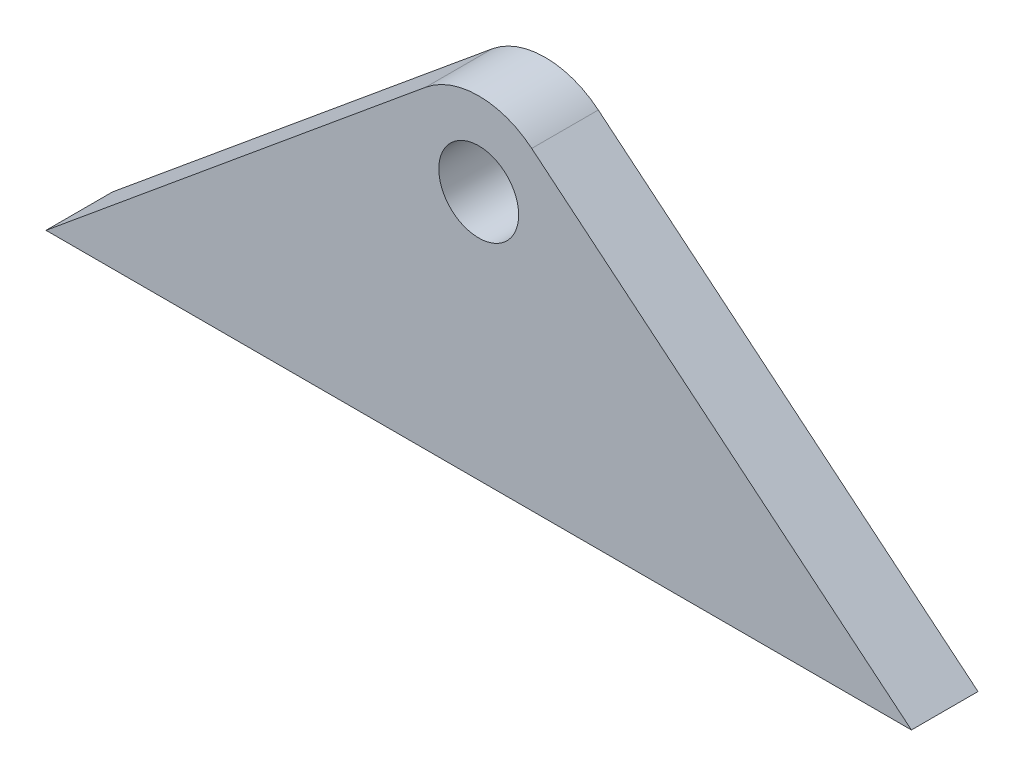
ISO-10303-21;
HEADER;
FILE_DESCRIPTION(('STEP AP214'),'2;1');
FILE_NAME('part.step','',(''),(''),'','','');
FILE_SCHEMA(('AUTOMOTIVE_DESIGN { 1 0 10303 214 1 1 1 1 }'));
ENDSEC;
DATA;
#1=APPLICATION_CONTEXT('core data for automotive mechanical design processes');
#2=APPLICATION_PROTOCOL_DEFINITION('international standard','automotive_design',2000,#1);
#3=PRODUCT_CONTEXT('',#1,'mechanical');
#4=PRODUCT('Part','Part','',(#3));
#5=PRODUCT_RELATED_PRODUCT_CATEGORY('part','',(#4));
#6=PRODUCT_DEFINITION_FORMATION('','',#4);
#7=PRODUCT_DEFINITION_CONTEXT('part definition',#1,'design');
#8=PRODUCT_DEFINITION('design','',#6,#7);
#9=PRODUCT_DEFINITION_SHAPE('','',#8);
#10=(LENGTH_UNIT() NAMED_UNIT(*) SI_UNIT(.MILLI.,.METRE.));
#11=(NAMED_UNIT(*) PLANE_ANGLE_UNIT() SI_UNIT($,.RADIAN.));
#12=(NAMED_UNIT(*) SI_UNIT($,.STERADIAN.) SOLID_ANGLE_UNIT());
#13=UNCERTAINTY_MEASURE_WITH_UNIT(LENGTH_MEASURE(1.E-05),#10,'distance_accuracy_value','');
#14=(GEOMETRIC_REPRESENTATION_CONTEXT(3) GLOBAL_UNCERTAINTY_ASSIGNED_CONTEXT((#13)) GLOBAL_UNIT_ASSIGNED_CONTEXT((#10,
#11,#12)) REPRESENTATION_CONTEXT('',''));
#15=CARTESIAN_POINT('',(0.,0.,0.));
#16=DIRECTION('',(0.,0.,1.));
#17=DIRECTION('',(1.,0.,0.));
#18=AXIS2_PLACEMENT_3D('',#15,#16,#17);
#19=CARTESIAN_POINT('',(0.,75.,10.));
#20=DIRECTION('',(0.,0.,1.));
#21=DIRECTION('',(1.,0.,0.));
#22=AXIS2_PLACEMENT_3D('',#19,#20,#21);
#23=PLANE('',#22);
#24=CARTESIAN_POINT('',(0.,75.,10.));
#25=DIRECTION('',(0.,0.,1.));
#26=DIRECTION('',(1.,0.,0.));
#27=AXIS2_PLACEMENT_3D('',#24,#25,#26);
#28=CIRCLE('',#27,25.);
#29=CARTESIAN_POINT('',(15.9256231300906,94.2710800921569,10.));
#30=VERTEX_POINT('',#29);
#31=CARTESIAN_POINT('',(-15.9256231300906,94.2710800921569,10.));
#32=VERTEX_POINT('',#31);
#33=EDGE_CURVE('E84',#30,#32,#28,.T.);
#34=ORIENTED_EDGE('',*,*,#33,.T.);
#35=DIRECTION('',(-0.770843203686276,-0.637024925203621,0.));
#36=VECTOR('',#35,1.);
#37=CARTESIAN_POINT('',(-130.,0.,10.));
#38=LINE('',#37,#36);
#39=CARTESIAN_POINT('',(-130.,0.,10.));
#40=VERTEX_POINT('',#39);
#41=EDGE_CURVE('E79',#32,#40,#38,.T.);
#42=ORIENTED_EDGE('',*,*,#41,.T.);
#43=DIRECTION('',(1.,0.,0.));
#44=VECTOR('',#43,1.);
#45=CARTESIAN_POINT('',(130.,0.,10.));
#46=LINE('',#45,#44);
#47=CARTESIAN_POINT('',(130.,0.,10.));
#48=VERTEX_POINT('',#47);
#49=EDGE_CURVE('E82',#40,#48,#46,.T.);
#50=ORIENTED_EDGE('',*,*,#49,.T.);
#51=DIRECTION('',(-0.770843203686276,0.637024925203621,0.));
#52=VECTOR('',#51,1.);
#53=CARTESIAN_POINT('',(130.,0.,10.));
#54=LINE('',#53,#52);
#55=EDGE_CURVE('E49',#48,#30,#54,.T.);
#56=ORIENTED_EDGE('',*,*,#55,.T.);
#57=EDGE_LOOP('',(#34,#42,#50,#56));
#58=FACE_BOUND('',#57,.T.);
#59=CARTESIAN_POINT('',(0.,75.,10.));
#60=DIRECTION('',(0.,0.,1.));
#61=DIRECTION('',(1.,0.,0.));
#62=AXIS2_PLACEMENT_3D('',#59,#60,#61);
#63=CIRCLE('',#62,12.);
#64=CARTESIAN_POINT('',(12.,75.,10.));
#65=VERTEX_POINT('',#64);
#66=EDGE_CURVE('E99',#65,#65,#63,.T.);
#67=ORIENTED_EDGE('',*,*,#66,.F.);
#68=EDGE_LOOP('',(#67));
#69=FACE_BOUND('',#68,.T.);
#70=ADVANCED_FACE('F32',(#58,#69),#23,.T.);
#71=CARTESIAN_POINT('',(0.,75.,-10.));
#72=DIRECTION('',(0.,0.,1.));
#73=DIRECTION('',(1.,0.,0.));
#74=AXIS2_PLACEMENT_3D('',#71,#72,#73);
#75=PLANE('',#74);
#76=CARTESIAN_POINT('',(0.,75.,-10.));
#77=DIRECTION('',(0.,0.,1.));
#78=DIRECTION('',(1.,0.,0.));
#79=AXIS2_PLACEMENT_3D('',#76,#77,#78);
#80=CIRCLE('',#79,25.);
#81=CARTESIAN_POINT('',(15.9256231300906,94.2710800921569,-10.));
#82=VERTEX_POINT('',#81);
#83=CARTESIAN_POINT('',(-15.9256231300906,94.2710800921569,-10.));
#84=VERTEX_POINT('',#83);
#85=EDGE_CURVE('E96',#82,#84,#80,.T.);
#86=ORIENTED_EDGE('',*,*,#85,.F.);
#87=DIRECTION('',(-0.770843203686276,0.637024925203621,0.));
#88=VECTOR('',#87,1.);
#89=CARTESIAN_POINT('',(130.,0.,-10.));
#90=LINE('',#89,#88);
#91=CARTESIAN_POINT('',(130.,0.,-10.));
#92=VERTEX_POINT('',#91);
#93=EDGE_CURVE('E72',#92,#82,#90,.T.);
#94=ORIENTED_EDGE('',*,*,#93,.F.);
#95=DIRECTION('',(1.,0.,0.));
#96=VECTOR('',#95,1.);
#97=CARTESIAN_POINT('',(130.,0.,-10.));
#98=LINE('',#97,#96);
#99=CARTESIAN_POINT('',(-130.,0.,-10.));
#100=VERTEX_POINT('',#99);
#101=EDGE_CURVE('E66',#100,#92,#98,.T.);
#102=ORIENTED_EDGE('',*,*,#101,.F.);
#103=DIRECTION('',(-0.770843203686276,-0.637024925203621,0.));
#104=VECTOR('',#103,1.);
#105=CARTESIAN_POINT('',(-130.,0.,-10.));
#106=LINE('',#105,#104);
#107=EDGE_CURVE('E88',#84,#100,#106,.T.);
#108=ORIENTED_EDGE('',*,*,#107,.F.);
#109=EDGE_LOOP('',(#86,#94,#102,#108));
#110=FACE_BOUND('',#109,.T.);
#111=CARTESIAN_POINT('',(0.,75.,-10.));
#112=DIRECTION('',(0.,0.,1.));
#113=DIRECTION('',(1.,0.,0.));
#114=AXIS2_PLACEMENT_3D('',#111,#112,#113);
#115=CIRCLE('',#114,12.);
#116=CARTESIAN_POINT('',(12.,75.,-10.));
#117=VERTEX_POINT('',#116);
#118=EDGE_CURVE('E111',#117,#117,#115,.T.);
#119=ORIENTED_EDGE('',*,*,#118,.T.);
#120=EDGE_LOOP('',(#119));
#121=FACE_BOUND('',#120,.T.);
#122=ADVANCED_FACE('F107',(#110,#121),#75,.F.);
#123=CARTESIAN_POINT('',(0.,75.,10.));
#124=DIRECTION('',(0.,0.,-1.));
#125=DIRECTION('',(-1.,0.,0.));
#126=AXIS2_PLACEMENT_3D('',#123,#124,#125);
#127=CYLINDRICAL_SURFACE('',#126,25.);
#128=ORIENTED_EDGE('',*,*,#85,.T.);
#129=DIRECTION('',(0.,0.,-1.));
#130=VECTOR('',#129,1.);
#131=CARTESIAN_POINT('',(-15.9256231300906,94.2710800921569,10.));
#132=LINE('',#131,#130);
#133=EDGE_CURVE('E11',#32,#84,#132,.T.);
#134=ORIENTED_EDGE('',*,*,#133,.F.);
#135=ORIENTED_EDGE('',*,*,#33,.F.);
#136=DIRECTION('',(0.,0.,-1.));
#137=VECTOR('',#136,1.);
#138=CARTESIAN_POINT('',(15.9256231300906,94.2710800921569,10.));
#139=LINE('',#138,#137);
#140=EDGE_CURVE('E92',#30,#82,#139,.T.);
#141=ORIENTED_EDGE('',*,*,#140,.T.);
#142=EDGE_LOOP('',(#128,#134,#135,#141));
#143=FACE_BOUND('',#142,.T.);
#144=ADVANCED_FACE('F34',(#143),#127,.T.);
#145=CARTESIAN_POINT('',(-130.,0.,10.));
#146=DIRECTION('',(0.637024925203621,-0.770843203686276,0.));
#147=DIRECTION('',(0.770843203686276,0.637024925203621,0.));
#148=AXIS2_PLACEMENT_3D('',#145,#146,#147);
#149=PLANE('',#148);
#150=ORIENTED_EDGE('',*,*,#107,.T.);
#151=DIRECTION('',(0.,0.,-1.));
#152=VECTOR('',#151,1.);
#153=CARTESIAN_POINT('',(-130.,0.,10.));
#154=LINE('',#153,#152);
#155=EDGE_CURVE('E41',#40,#100,#154,.T.);
#156=ORIENTED_EDGE('',*,*,#155,.F.);
#157=ORIENTED_EDGE('',*,*,#41,.F.);
#158=ORIENTED_EDGE('',*,*,#133,.T.);
#159=EDGE_LOOP('',(#150,#156,#157,#158));
#160=FACE_BOUND('',#159,.T.);
#161=ADVANCED_FACE('F87',(#160),#149,.F.);
#162=CARTESIAN_POINT('',(130.,0.,10.));
#163=DIRECTION('',(0.,1.,0.));
#164=DIRECTION('',(0.,0.,1.));
#165=AXIS2_PLACEMENT_3D('',#162,#163,#164);
#166=PLANE('',#165);
#167=ORIENTED_EDGE('',*,*,#101,.T.);
#168=DIRECTION('',(0.,0.,-1.));
#169=VECTOR('',#168,1.);
#170=CARTESIAN_POINT('',(130.,0.,10.));
#171=LINE('',#170,#169);
#172=EDGE_CURVE('E89',#48,#92,#171,.T.);
#173=ORIENTED_EDGE('',*,*,#172,.F.);
#174=ORIENTED_EDGE('',*,*,#49,.F.);
#175=ORIENTED_EDGE('',*,*,#155,.T.);
#176=EDGE_LOOP('',(#167,#173,#174,#175));
#177=FACE_BOUND('',#176,.T.);
#178=ADVANCED_FACE('F90',(#177),#166,.F.);
#179=CARTESIAN_POINT('',(130.,0.,10.));
#180=DIRECTION('',(-0.637024925203621,-0.770843203686276,0.));
#181=DIRECTION('',(0.770843203686276,-0.637024925203621,0.));
#182=AXIS2_PLACEMENT_3D('',#179,#180,#181);
#183=PLANE('',#182);
#184=ORIENTED_EDGE('',*,*,#93,.T.);
#185=ORIENTED_EDGE('',*,*,#140,.F.);
#186=ORIENTED_EDGE('',*,*,#55,.F.);
#187=ORIENTED_EDGE('',*,*,#172,.T.);
#188=EDGE_LOOP('',(#184,#185,#186,#187));
#189=FACE_BOUND('',#188,.T.);
#190=ADVANCED_FACE('F104',(#189),#183,.F.);
#191=CARTESIAN_POINT('',(0.,75.,10.));
#192=DIRECTION('',(0.,0.,-1.));
#193=DIRECTION('',(-1.,0.,0.));
#194=AXIS2_PLACEMENT_3D('',#191,#192,#193);
#195=CYLINDRICAL_SURFACE('',#194,12.);
#196=ORIENTED_EDGE('',*,*,#66,.T.);
#197=EDGE_LOOP('',(#196));
#198=FACE_BOUND('',#197,.T.);
#199=ORIENTED_EDGE('',*,*,#118,.F.);
#200=EDGE_LOOP('',(#199));
#201=FACE_BOUND('',#200,.T.);
#202=ADVANCED_FACE('F117',(#198,#201),#195,.F.);
#203=CLOSED_SHELL('',(#70,#122,#144,#161,#178,#190,#202));
#204=MANIFOLD_SOLID_BREP('B2',#203);
#205=ADVANCED_BREP_SHAPE_REPRESENTATION('',(#18,#204),#14);
#206=SHAPE_DEFINITION_REPRESENTATION(#9,#205);
ENDSEC;
END-ISO-10303-21;
